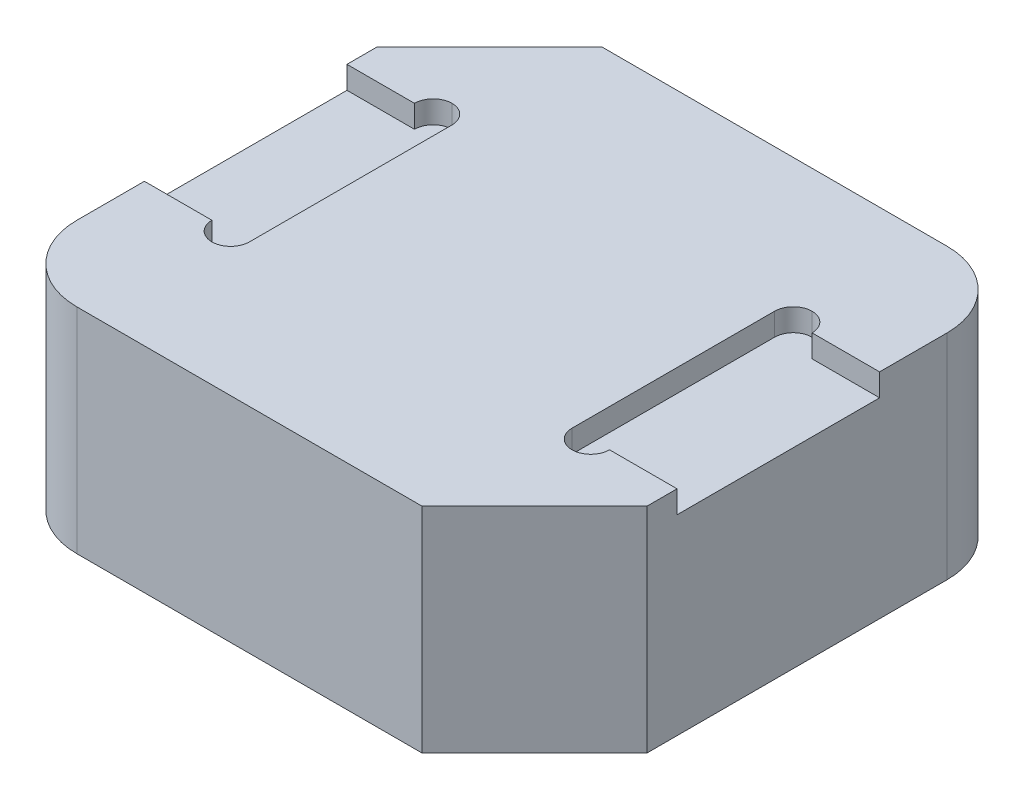
ISO-10303-21;
HEADER;
FILE_DESCRIPTION(('STEP AP214'),'2;1');
FILE_NAME('part.step','',(''),(''),'','','');
FILE_SCHEMA(('AUTOMOTIVE_DESIGN { 1 0 10303 214 1 1 1 1 }'));
ENDSEC;
DATA;
#1=APPLICATION_CONTEXT('core data for automotive mechanical design processes');
#2=APPLICATION_PROTOCOL_DEFINITION('international standard','automotive_design',2000,#1);
#3=PRODUCT_CONTEXT('',#1,'mechanical');
#4=PRODUCT('Part','Part','',(#3));
#5=PRODUCT_RELATED_PRODUCT_CATEGORY('part','',(#4));
#6=PRODUCT_DEFINITION_FORMATION('','',#4);
#7=PRODUCT_DEFINITION_CONTEXT('part definition',#1,'design');
#8=PRODUCT_DEFINITION('design','',#6,#7);
#9=PRODUCT_DEFINITION_SHAPE('','',#8);
#10=(LENGTH_UNIT() NAMED_UNIT(*) SI_UNIT(.MILLI.,.METRE.));
#11=(NAMED_UNIT(*) PLANE_ANGLE_UNIT() SI_UNIT($,.RADIAN.));
#12=(NAMED_UNIT(*) SI_UNIT($,.STERADIAN.) SOLID_ANGLE_UNIT());
#13=UNCERTAINTY_MEASURE_WITH_UNIT(LENGTH_MEASURE(1.E-05),#10,'distance_accuracy_value','');
#14=(GEOMETRIC_REPRESENTATION_CONTEXT(3) GLOBAL_UNCERTAINTY_ASSIGNED_CONTEXT((#13)) GLOBAL_UNIT_ASSIGNED_CONTEXT((#10,
#11,#12)) REPRESENTATION_CONTEXT('',''));
#15=CARTESIAN_POINT('',(0.,0.,0.));
#16=DIRECTION('',(0.,0.,1.));
#17=DIRECTION('',(1.,0.,0.));
#18=AXIS2_PLACEMENT_3D('',#15,#16,#17);
#19=CARTESIAN_POINT('',(0.,2.85,0.));
#20=DIRECTION('',(0.,-1.,0.));
#21=DIRECTION('',(0.,0.,-1.));
#22=AXIS2_PLACEMENT_3D('',#19,#20,#21);
#23=PLANE('',#22);
#24=CARTESIAN_POINT('',(-2.4,2.85,-1.35));
#25=DIRECTION('',(0.,-1.,0.));
#26=DIRECTION('',(0.,0.,-1.));
#27=AXIS2_PLACEMENT_3D('',#24,#25,#26);
#28=CIRCLE('',#27,0.25);
#29=CARTESIAN_POINT('',(-2.65,2.85,-1.35));
#30=VERTEX_POINT('',#29);
#31=CARTESIAN_POINT('',(-2.4,2.85,-1.6));
#32=VERTEX_POINT('',#31);
#33=EDGE_CURVE('E48',#30,#32,#28,.T.);
#34=ORIENTED_EDGE('',*,*,#33,.T.);
#35=CARTESIAN_POINT('',(-2.4,2.85,-1.35));
#36=DIRECTION('',(0.,-1.,0.));
#37=DIRECTION('',(0.,0.,-1.));
#38=AXIS2_PLACEMENT_3D('',#35,#36,#37);
#39=CIRCLE('',#38,0.25);
#40=CARTESIAN_POINT('',(-2.15,2.85,-1.35));
#41=VERTEX_POINT('',#40);
#42=EDGE_CURVE('E11',#32,#41,#39,.T.);
#43=ORIENTED_EDGE('',*,*,#42,.T.);
#44=DIRECTION('',(0.,0.,1.));
#45=VECTOR('',#44,1.);
#46=CARTESIAN_POINT('',(-2.15,2.85,-1.6));
#47=LINE('',#46,#45);
#48=CARTESIAN_POINT('',(-2.15,2.85,1.35));
#49=VERTEX_POINT('',#48);
#50=EDGE_CURVE('E423',#41,#49,#47,.T.);
#51=ORIENTED_EDGE('',*,*,#50,.T.);
#52=CARTESIAN_POINT('',(-2.4,2.85,1.35));
#53=DIRECTION('',(0.,-1.,0.));
#54=DIRECTION('',(0.,0.,-1.));
#55=AXIS2_PLACEMENT_3D('',#52,#53,#54);
#56=CIRCLE('',#55,0.25);
#57=CARTESIAN_POINT('',(-2.4,2.85,1.6));
#58=VERTEX_POINT('',#57);
#59=EDGE_CURVE('E61',#49,#58,#56,.T.);
#60=ORIENTED_EDGE('',*,*,#59,.T.);
#61=CARTESIAN_POINT('',(-2.4,2.85,1.35));
#62=DIRECTION('',(0.,-1.,0.));
#63=DIRECTION('',(0.,0.,-1.));
#64=AXIS2_PLACEMENT_3D('',#61,#62,#63);
#65=CIRCLE('',#64,0.25);
#66=CARTESIAN_POINT('',(-2.65,2.85,1.35));
#67=VERTEX_POINT('',#66);
#68=EDGE_CURVE('E199',#58,#67,#65,.T.);
#69=ORIENTED_EDGE('',*,*,#68,.T.);
#70=DIRECTION('',(-1.,0.,0.));
#71=VECTOR('',#70,1.);
#72=CARTESIAN_POINT('',(-3.55,2.85,1.35));
#73=LINE('',#72,#71);
#74=CARTESIAN_POINT('',(-3.55,2.85,1.35));
#75=VERTEX_POINT('',#74);
#76=EDGE_CURVE('E201',#67,#75,#73,.T.);
#77=ORIENTED_EDGE('',*,*,#76,.T.);
#78=DIRECTION('',(0.,0.,1.));
#79=VECTOR('',#78,1.);
#80=CARTESIAN_POINT('',(-3.55,2.85,3.25));
#81=LINE('',#80,#79);
#82=CARTESIAN_POINT('',(-3.55,2.85,2.25));
#83=VERTEX_POINT('',#82);
#84=EDGE_CURVE('E286',#75,#83,#81,.T.);
#85=ORIENTED_EDGE('',*,*,#84,.T.);
#86=CARTESIAN_POINT('',(-2.55,2.85,2.25));
#87=DIRECTION('',(0.,-1.,0.));
#88=DIRECTION('',(0.,0.,-1.));
#89=AXIS2_PLACEMENT_3D('',#86,#87,#88);
#90=CIRCLE('',#89,1.);
#91=CARTESIAN_POINT('',(-2.55,2.85,3.25));
#92=VERTEX_POINT('',#91);
#93=EDGE_CURVE('E351',#83,#92,#90,.F.);
#94=ORIENTED_EDGE('',*,*,#93,.T.);
#95=DIRECTION('',(1.,0.,0.));
#96=VECTOR('',#95,1.);
#97=CARTESIAN_POINT('',(-3.55,2.85,3.25));
#98=LINE('',#97,#96);
#99=CARTESIAN_POINT('',(2.04999999999999,2.85,3.25));
#100=VERTEX_POINT('',#99);
#101=EDGE_CURVE('E291',#92,#100,#98,.T.);
#102=ORIENTED_EDGE('',*,*,#101,.T.);
#103=DIRECTION('',(-0.707106781186549,0.,0.707106781186546));
#104=VECTOR('',#103,1.);
#105=CARTESIAN_POINT('',(3.55,2.85,1.75));
#106=LINE('',#105,#104);
#107=CARTESIAN_POINT('',(3.55,2.85,1.75));
#108=VERTEX_POINT('',#107);
#109=EDGE_CURVE('E326',#100,#108,#106,.F.);
#110=ORIENTED_EDGE('',*,*,#109,.T.);
#111=DIRECTION('',(0.,0.,-1.));
#112=VECTOR('',#111,1.);
#113=CARTESIAN_POINT('',(3.55,2.85,3.25));
#114=LINE('',#113,#112);
#115=CARTESIAN_POINT('',(3.55,2.85,1.35));
#116=VERTEX_POINT('',#115);
#117=EDGE_CURVE('E278',#108,#116,#114,.T.);
#118=ORIENTED_EDGE('',*,*,#117,.T.);
#119=DIRECTION('',(1.,0.,0.));
#120=VECTOR('',#119,1.);
#121=CARTESIAN_POINT('',(3.55,2.85,1.35));
#122=LINE('',#121,#120);
#123=CARTESIAN_POINT('',(2.65,2.85,1.35));
#124=VERTEX_POINT('',#123);
#125=EDGE_CURVE('E249',#124,#116,#122,.T.);
#126=ORIENTED_EDGE('',*,*,#125,.F.);
#127=CARTESIAN_POINT('',(2.4,2.85,1.35));
#128=DIRECTION('',(0.,-1.,0.));
#129=DIRECTION('',(0.,0.,-1.));
#130=AXIS2_PLACEMENT_3D('',#127,#128,#129);
#131=CIRCLE('',#130,0.25);
#132=CARTESIAN_POINT('',(2.4,2.85,1.6));
#133=VERTEX_POINT('',#132);
#134=EDGE_CURVE('E383',#124,#133,#131,.T.);
#135=ORIENTED_EDGE('',*,*,#134,.T.);
#136=CARTESIAN_POINT('',(2.4,2.85,1.35));
#137=DIRECTION('',(0.,-1.,0.));
#138=DIRECTION('',(0.,0.,-1.));
#139=AXIS2_PLACEMENT_3D('',#136,#137,#138);
#140=CIRCLE('',#139,0.25);
#141=CARTESIAN_POINT('',(2.15,2.85,1.35));
#142=VERTEX_POINT('',#141);
#143=EDGE_CURVE('E386',#133,#142,#140,.T.);
#144=ORIENTED_EDGE('',*,*,#143,.T.);
#145=DIRECTION('',(0.,0.,1.));
#146=VECTOR('',#145,1.);
#147=CARTESIAN_POINT('',(2.15,2.85,-1.6));
#148=LINE('',#147,#146);
#149=CARTESIAN_POINT('',(2.15,2.85,-1.35));
#150=VERTEX_POINT('',#149);
#151=EDGE_CURVE('E239',#150,#142,#148,.T.);
#152=ORIENTED_EDGE('',*,*,#151,.F.);
#153=CARTESIAN_POINT('',(2.4,2.85,-1.35));
#154=DIRECTION('',(0.,-1.,0.));
#155=DIRECTION('',(0.,0.,-1.));
#156=AXIS2_PLACEMENT_3D('',#153,#154,#155);
#157=CIRCLE('',#156,0.25);
#158=CARTESIAN_POINT('',(2.4,2.85,-1.6));
#159=VERTEX_POINT('',#158);
#160=EDGE_CURVE('E392',#150,#159,#157,.T.);
#161=ORIENTED_EDGE('',*,*,#160,.T.);
#162=CARTESIAN_POINT('',(2.4,2.85,-1.35));
#163=DIRECTION('',(0.,-1.,0.));
#164=DIRECTION('',(0.,0.,-1.));
#165=AXIS2_PLACEMENT_3D('',#162,#163,#164);
#166=CIRCLE('',#165,0.25);
#167=CARTESIAN_POINT('',(2.65,2.85,-1.35));
#168=VERTEX_POINT('',#167);
#169=EDGE_CURVE('E389',#159,#168,#166,.T.);
#170=ORIENTED_EDGE('',*,*,#169,.T.);
#171=DIRECTION('',(-1.,0.,0.));
#172=VECTOR('',#171,1.);
#173=CARTESIAN_POINT('',(3.55,2.85,-1.35));
#174=LINE('',#173,#172);
#175=CARTESIAN_POINT('',(3.55,2.85,-1.35));
#176=VERTEX_POINT('',#175);
#177=EDGE_CURVE('E238',#176,#168,#174,.T.);
#178=ORIENTED_EDGE('',*,*,#177,.F.);
#179=CARTESIAN_POINT('',(3.55,2.85,-2.25));
#180=VERTEX_POINT('',#179);
#181=EDGE_CURVE('E283',#176,#180,#114,.T.);
#182=ORIENTED_EDGE('',*,*,#181,.T.);
#183=CARTESIAN_POINT('',(2.55,2.85,-2.25));
#184=DIRECTION('',(0.,-1.,0.));
#185=DIRECTION('',(0.,0.,-1.));
#186=AXIS2_PLACEMENT_3D('',#183,#184,#185);
#187=CIRCLE('',#186,1.);
#188=CARTESIAN_POINT('',(2.55,2.85,-3.25));
#189=VERTEX_POINT('',#188);
#190=EDGE_CURVE('E354',#180,#189,#187,.F.);
#191=ORIENTED_EDGE('',*,*,#190,.T.);
#192=DIRECTION('',(-1.,0.,0.));
#193=VECTOR('',#192,1.);
#194=CARTESIAN_POINT('',(-3.55,2.85,-3.25));
#195=LINE('',#194,#193);
#196=CARTESIAN_POINT('',(-2.05,2.85,-3.25));
#197=VERTEX_POINT('',#196);
#198=EDGE_CURVE('E282',#189,#197,#195,.T.);
#199=ORIENTED_EDGE('',*,*,#198,.T.);
#200=DIRECTION('',(0.707106781186549,0.,-0.707106781186546));
#201=VECTOR('',#200,1.);
#202=CARTESIAN_POINT('',(-3.55,2.85,-1.75));
#203=LINE('',#202,#201);
#204=CARTESIAN_POINT('',(-3.55,2.85,-1.75));
#205=VERTEX_POINT('',#204);
#206=EDGE_CURVE('E323',#197,#205,#203,.F.);
#207=ORIENTED_EDGE('',*,*,#206,.T.);
#208=CARTESIAN_POINT('',(-3.55,2.85,-1.35));
#209=VERTEX_POINT('',#208);
#210=EDGE_CURVE('E287',#205,#209,#81,.T.);
#211=ORIENTED_EDGE('',*,*,#210,.T.);
#212=DIRECTION('',(1.,0.,0.));
#213=VECTOR('',#212,1.);
#214=CARTESIAN_POINT('',(-3.55,2.85,-1.35));
#215=LINE('',#214,#213);
#216=EDGE_CURVE('E217',#209,#30,#215,.T.);
#217=ORIENTED_EDGE('',*,*,#216,.T.);
#218=EDGE_LOOP('',(#34,#43,#51,#60,#69,#77,#85,#94,#102,#110,#118,#126,#135,#144,#152,#161,#170,
#178,#182,#191,#199,#207,#211,#217));
#219=FACE_BOUND('',#218,.T.);
#220=ADVANCED_FACE('F38',(#219),#23,.F.);
#221=CARTESIAN_POINT('',(-3.55,2.85,3.25));
#222=DIRECTION('',(1.,0.,0.));
#223=DIRECTION('',(0.,0.,-1.));
#224=AXIS2_PLACEMENT_3D('',#221,#222,#223);
#225=PLANE('',#224);
#226=DIRECTION('',(0.,1.,0.));
#227=VECTOR('',#226,1.);
#228=CARTESIAN_POINT('',(-3.55,2.55,-1.35));
#229=LINE('',#228,#227);
#230=CARTESIAN_POINT('',(-3.55,2.55,-1.35));
#231=VERTEX_POINT('',#230);
#232=EDGE_CURVE('E228',#231,#209,#229,.T.);
#233=ORIENTED_EDGE('',*,*,#232,.T.);
#234=ORIENTED_EDGE('',*,*,#210,.F.);
#235=DIRECTION('',(0.,-1.,0.));
#236=VECTOR('',#235,1.);
#237=CARTESIAN_POINT('',(-3.55,2.85,-1.75));
#238=LINE('',#237,#236);
#239=CARTESIAN_POINT('',(-3.55,0.,-1.75));
#240=VERTEX_POINT('',#239);
#241=EDGE_CURVE('E329',#205,#240,#238,.T.);
#242=ORIENTED_EDGE('',*,*,#241,.T.);
#243=DIRECTION('',(0.,0.,1.));
#244=VECTOR('',#243,1.);
#245=CARTESIAN_POINT('',(-3.55,0.,3.25));
#246=LINE('',#245,#244);
#247=CARTESIAN_POINT('',(-3.55,0.,2.25));
#248=VERTEX_POINT('',#247);
#249=EDGE_CURVE('E301',#240,#248,#246,.T.);
#250=ORIENTED_EDGE('',*,*,#249,.T.);
#251=DIRECTION('',(0.,-1.,0.));
#252=VECTOR('',#251,1.);
#253=CARTESIAN_POINT('',(-3.55,2.85,2.25));
#254=LINE('',#253,#252);
#255=EDGE_CURVE('E361',#248,#83,#254,.F.);
#256=ORIENTED_EDGE('',*,*,#255,.T.);
#257=ORIENTED_EDGE('',*,*,#84,.F.);
#258=DIRECTION('',(0.,1.,0.));
#259=VECTOR('',#258,1.);
#260=CARTESIAN_POINT('',(-3.55,2.55,1.35));
#261=LINE('',#260,#259);
#262=CARTESIAN_POINT('',(-3.55,2.55,1.35));
#263=VERTEX_POINT('',#262);
#264=EDGE_CURVE('E215',#263,#75,#261,.T.);
#265=ORIENTED_EDGE('',*,*,#264,.F.);
#266=DIRECTION('',(0.,0.,-1.));
#267=VECTOR('',#266,1.);
#268=CARTESIAN_POINT('',(-3.55,2.55,-1.35));
#269=LINE('',#268,#267);
#270=EDGE_CURVE('E450',#263,#231,#269,.T.);
#271=ORIENTED_EDGE('',*,*,#270,.T.);
#272=EDGE_LOOP('',(#233,#234,#242,#250,#256,#257,#265,#271));
#273=FACE_BOUND('',#272,.T.);
#274=ADVANCED_FACE('F465',(#273),#225,.F.);
#275=CARTESIAN_POINT('',(3.55,2.85,3.25));
#276=DIRECTION('',(-1.,0.,0.));
#277=DIRECTION('',(0.,0.,1.));
#278=AXIS2_PLACEMENT_3D('',#275,#276,#277);
#279=PLANE('',#278);
#280=DIRECTION('',(0.,0.,-1.));
#281=VECTOR('',#280,1.);
#282=CARTESIAN_POINT('',(3.55,2.55,-1.35));
#283=LINE('',#282,#281);
#284=CARTESIAN_POINT('',(3.55,2.55,1.35));
#285=VERTEX_POINT('',#284);
#286=CARTESIAN_POINT('',(3.55,2.55,-1.35));
#287=VERTEX_POINT('',#286);
#288=EDGE_CURVE('E244',#285,#287,#283,.T.);
#289=ORIENTED_EDGE('',*,*,#288,.F.);
#290=DIRECTION('',(0.,1.,0.));
#291=VECTOR('',#290,1.);
#292=CARTESIAN_POINT('',(3.55,2.55,1.35));
#293=LINE('',#292,#291);
#294=EDGE_CURVE('E263',#285,#116,#293,.T.);
#295=ORIENTED_EDGE('',*,*,#294,.T.);
#296=ORIENTED_EDGE('',*,*,#117,.F.);
#297=DIRECTION('',(0.,-1.,0.));
#298=VECTOR('',#297,1.);
#299=CARTESIAN_POINT('',(3.55,2.85,1.75));
#300=LINE('',#299,#298);
#301=CARTESIAN_POINT('',(3.55,0.,1.75));
#302=VERTEX_POINT('',#301);
#303=EDGE_CURVE('E294',#108,#302,#300,.T.);
#304=ORIENTED_EDGE('',*,*,#303,.T.);
#305=DIRECTION('',(0.,0.,-1.));
#306=VECTOR('',#305,1.);
#307=CARTESIAN_POINT('',(3.55,0.,3.25));
#308=LINE('',#307,#306);
#309=CARTESIAN_POINT('',(3.55,0.,-2.25));
#310=VERTEX_POINT('',#309);
#311=EDGE_CURVE('E267',#302,#310,#308,.T.);
#312=ORIENTED_EDGE('',*,*,#311,.T.);
#313=DIRECTION('',(0.,-1.,0.));
#314=VECTOR('',#313,1.);
#315=CARTESIAN_POINT('',(3.55,2.85,-2.25));
#316=LINE('',#315,#314);
#317=EDGE_CURVE('E347',#310,#180,#316,.F.);
#318=ORIENTED_EDGE('',*,*,#317,.T.);
#319=ORIENTED_EDGE('',*,*,#181,.F.);
#320=DIRECTION('',(0.,1.,0.));
#321=VECTOR('',#320,1.);
#322=CARTESIAN_POINT('',(3.55,2.55,-1.35));
#323=LINE('',#322,#321);
#324=EDGE_CURVE('E257',#287,#176,#323,.T.);
#325=ORIENTED_EDGE('',*,*,#324,.F.);
#326=EDGE_LOOP('',(#289,#295,#296,#304,#312,#318,#319,#325));
#327=FACE_BOUND('',#326,.T.);
#328=ADVANCED_FACE('F498',(#327),#279,.F.);
#329=CARTESIAN_POINT('',(-3.55,2.85,-3.25));
#330=DIRECTION('',(0.,0.,1.));
#331=DIRECTION('',(1.,0.,0.));
#332=AXIS2_PLACEMENT_3D('',#329,#330,#331);
#333=PLANE('',#332);
#334=ORIENTED_EDGE('',*,*,#198,.F.);
#335=DIRECTION('',(0.,-1.,0.));
#336=VECTOR('',#335,1.);
#337=CARTESIAN_POINT('',(2.55,2.85,-3.25));
#338=LINE('',#337,#336);
#339=CARTESIAN_POINT('',(2.55,0.,-3.25));
#340=VERTEX_POINT('',#339);
#341=EDGE_CURVE('E337',#189,#340,#338,.T.);
#342=ORIENTED_EDGE('',*,*,#341,.T.);
#343=DIRECTION('',(-1.,0.,0.));
#344=VECTOR('',#343,1.);
#345=CARTESIAN_POINT('',(-3.55,0.,-3.25));
#346=LINE('',#345,#344);
#347=CARTESIAN_POINT('',(-2.05,0.,-3.25));
#348=VERTEX_POINT('',#347);
#349=EDGE_CURVE('E298',#340,#348,#346,.T.);
#350=ORIENTED_EDGE('',*,*,#349,.T.);
#351=DIRECTION('',(0.,1.,0.));
#352=VECTOR('',#351,1.);
#353=CARTESIAN_POINT('',(-2.05,2.85,-3.25));
#354=LINE('',#353,#352);
#355=EDGE_CURVE('E333',#348,#197,#354,.T.);
#356=ORIENTED_EDGE('',*,*,#355,.T.);
#357=EDGE_LOOP('',(#334,#342,#350,#356));
#358=FACE_BOUND('',#357,.T.);
#359=ADVANCED_FACE('F504',(#358),#333,.F.);
#360=CARTESIAN_POINT('',(-3.55,2.85,3.25));
#361=DIRECTION('',(0.,0.,-1.));
#362=DIRECTION('',(-1.,0.,0.));
#363=AXIS2_PLACEMENT_3D('',#360,#361,#362);
#364=PLANE('',#363);
#365=ORIENTED_EDGE('',*,*,#101,.F.);
#366=DIRECTION('',(0.,-1.,0.));
#367=VECTOR('',#366,1.);
#368=CARTESIAN_POINT('',(-2.55,2.85,3.25));
#369=LINE('',#368,#367);
#370=CARTESIAN_POINT('',(-2.55,0.,3.25));
#371=VERTEX_POINT('',#370);
#372=EDGE_CURVE('E357',#92,#371,#369,.T.);
#373=ORIENTED_EDGE('',*,*,#372,.T.);
#374=DIRECTION('',(1.,0.,0.));
#375=VECTOR('',#374,1.);
#376=CARTESIAN_POINT('',(-3.55,0.,3.25));
#377=LINE('',#376,#375);
#378=CARTESIAN_POINT('',(2.04999999999999,0.,3.25));
#379=VERTEX_POINT('',#378);
#380=EDGE_CURVE('E305',#371,#379,#377,.T.);
#381=ORIENTED_EDGE('',*,*,#380,.T.);
#382=DIRECTION('',(0.,1.,0.));
#383=VECTOR('',#382,1.);
#384=CARTESIAN_POINT('',(2.05,2.85,3.25));
#385=LINE('',#384,#383);
#386=EDGE_CURVE('E319',#379,#100,#385,.T.);
#387=ORIENTED_EDGE('',*,*,#386,.T.);
#388=EDGE_LOOP('',(#365,#373,#381,#387));
#389=FACE_BOUND('',#388,.T.);
#390=ADVANCED_FACE('F485',(#389),#364,.F.);
#391=CARTESIAN_POINT('',(0.,0.,0.));
#392=DIRECTION('',(0.,-1.,0.));
#393=DIRECTION('',(0.,0.,-1.));
#394=AXIS2_PLACEMENT_3D('',#391,#392,#393);
#395=PLANE('',#394);
#396=ORIENTED_EDGE('',*,*,#349,.F.);
#397=CARTESIAN_POINT('',(2.55,0.,-2.25));
#398=DIRECTION('',(0.,-1.,0.));
#399=DIRECTION('',(0.,0.,-1.));
#400=AXIS2_PLACEMENT_3D('',#397,#398,#399);
#401=CIRCLE('',#400,1.);
#402=EDGE_CURVE('E344',#340,#310,#401,.T.);
#403=ORIENTED_EDGE('',*,*,#402,.T.);
#404=ORIENTED_EDGE('',*,*,#311,.F.);
#405=DIRECTION('',(0.707106781186549,0.,-0.707106781186546));
#406=VECTOR('',#405,1.);
#407=CARTESIAN_POINT('',(2.64999999999999,0.,2.65));
#408=LINE('',#407,#406);
#409=EDGE_CURVE('E315',#302,#379,#408,.F.);
#410=ORIENTED_EDGE('',*,*,#409,.T.);
#411=ORIENTED_EDGE('',*,*,#380,.F.);
#412=CARTESIAN_POINT('',(-2.55,0.,2.25));
#413=DIRECTION('',(0.,-1.,0.));
#414=DIRECTION('',(0.,0.,-1.));
#415=AXIS2_PLACEMENT_3D('',#412,#413,#414);
#416=CIRCLE('',#415,1.);
#417=EDGE_CURVE('E341',#371,#248,#416,.T.);
#418=ORIENTED_EDGE('',*,*,#417,.T.);
#419=ORIENTED_EDGE('',*,*,#249,.F.);
#420=DIRECTION('',(-0.707106781186549,0.,0.707106781186546));
#421=VECTOR('',#420,1.);
#422=CARTESIAN_POINT('',(-2.64999999999999,0.,-2.65));
#423=LINE('',#422,#421);
#424=EDGE_CURVE('E311',#240,#348,#423,.F.);
#425=ORIENTED_EDGE('',*,*,#424,.T.);
#426=EDGE_LOOP('',(#396,#403,#404,#410,#411,#418,#419,#425));
#427=FACE_BOUND('',#426,.T.);
#428=ADVANCED_FACE('F477',(#427),#395,.T.);
#429=CARTESIAN_POINT('',(3.55,2.85,1.75));
#430=DIRECTION('',(-0.707106781186546,0.,-0.707106781186549));
#431=DIRECTION('',(0.,-1.,0.));
#432=AXIS2_PLACEMENT_3D('',#429,#430,#431);
#433=PLANE('',#432);
#434=ORIENTED_EDGE('',*,*,#109,.F.);
#435=ORIENTED_EDGE('',*,*,#386,.F.);
#436=ORIENTED_EDGE('',*,*,#409,.F.);
#437=ORIENTED_EDGE('',*,*,#303,.F.);
#438=EDGE_LOOP('',(#434,#435,#436,#437));
#439=FACE_BOUND('',#438,.T.);
#440=ADVANCED_FACE('F507',(#439),#433,.F.);
#441=CARTESIAN_POINT('',(-3.55,2.85,-1.75));
#442=DIRECTION('',(0.707106781186546,0.,0.707106781186549));
#443=DIRECTION('',(0.,-1.,0.));
#444=AXIS2_PLACEMENT_3D('',#441,#442,#443);
#445=PLANE('',#444);
#446=ORIENTED_EDGE('',*,*,#206,.F.);
#447=ORIENTED_EDGE('',*,*,#355,.F.);
#448=ORIENTED_EDGE('',*,*,#424,.F.);
#449=ORIENTED_EDGE('',*,*,#241,.F.);
#450=EDGE_LOOP('',(#446,#447,#448,#449));
#451=FACE_BOUND('',#450,.T.);
#452=ADVANCED_FACE('F472',(#451),#445,.F.);
#453=CARTESIAN_POINT('',(2.55,2.85,-2.25));
#454=DIRECTION('',(0.,-1.,0.));
#455=DIRECTION('',(0.,0.,-1.));
#456=AXIS2_PLACEMENT_3D('',#453,#454,#455);
#457=CYLINDRICAL_SURFACE('',#456,1.);
#458=ORIENTED_EDGE('',*,*,#190,.F.);
#459=ORIENTED_EDGE('',*,*,#317,.F.);
#460=ORIENTED_EDGE('',*,*,#402,.F.);
#461=ORIENTED_EDGE('',*,*,#341,.F.);
#462=EDGE_LOOP('',(#458,#459,#460,#461));
#463=FACE_BOUND('',#462,.T.);
#464=ADVANCED_FACE('F502',(#463),#457,.T.);
#465=CARTESIAN_POINT('',(-2.55,2.85,2.25));
#466=DIRECTION('',(0.,-1.,0.));
#467=DIRECTION('',(0.,0.,-1.));
#468=AXIS2_PLACEMENT_3D('',#465,#466,#467);
#469=CYLINDRICAL_SURFACE('',#468,1.);
#470=ORIENTED_EDGE('',*,*,#93,.F.);
#471=ORIENTED_EDGE('',*,*,#255,.F.);
#472=ORIENTED_EDGE('',*,*,#417,.F.);
#473=ORIENTED_EDGE('',*,*,#372,.F.);
#474=EDGE_LOOP('',(#470,#471,#472,#473));
#475=FACE_BOUND('',#474,.T.);
#476=ADVANCED_FACE('F482',(#475),#469,.T.);
#477=CARTESIAN_POINT('',(3.55,2.55,1.35));
#478=DIRECTION('',(0.,0.,1.));
#479=DIRECTION('',(1.,0.,0.));
#480=AXIS2_PLACEMENT_3D('',#477,#478,#479);
#481=PLANE('',#480);
#482=ORIENTED_EDGE('',*,*,#125,.T.);
#483=ORIENTED_EDGE('',*,*,#294,.F.);
#484=DIRECTION('',(1.,0.,0.));
#485=VECTOR('',#484,1.);
#486=CARTESIAN_POINT('',(3.55,2.55,1.35));
#487=LINE('',#486,#485);
#488=CARTESIAN_POINT('',(2.65,2.55,1.35));
#489=VERTEX_POINT('',#488);
#490=EDGE_CURVE('E253',#489,#285,#487,.T.);
#491=ORIENTED_EDGE('',*,*,#490,.F.);
#492=DIRECTION('',(0.,1.,0.));
#493=VECTOR('',#492,1.);
#494=CARTESIAN_POINT('',(2.65,2.55,1.35));
#495=LINE('',#494,#493);
#496=EDGE_CURVE('E268',#489,#124,#495,.T.);
#497=ORIENTED_EDGE('',*,*,#496,.T.);
#498=EDGE_LOOP('',(#482,#483,#491,#497));
#499=FACE_BOUND('',#498,.T.);
#500=ADVANCED_FACE('F511',(#499),#481,.F.);
#501=CARTESIAN_POINT('',(3.55,2.55,-1.35));
#502=DIRECTION('',(0.,0.,-1.));
#503=DIRECTION('',(-1.,0.,0.));
#504=AXIS2_PLACEMENT_3D('',#501,#502,#503);
#505=PLANE('',#504);
#506=ORIENTED_EDGE('',*,*,#177,.T.);
#507=DIRECTION('',(0.,1.,0.));
#508=VECTOR('',#507,1.);
#509=CARTESIAN_POINT('',(2.65,2.55,-1.35));
#510=LINE('',#509,#508);
#511=CARTESIAN_POINT('',(2.65,2.55,-1.35));
#512=VERTEX_POINT('',#511);
#513=EDGE_CURVE('E272',#512,#168,#510,.T.);
#514=ORIENTED_EDGE('',*,*,#513,.F.);
#515=DIRECTION('',(-1.,0.,0.));
#516=VECTOR('',#515,1.);
#517=CARTESIAN_POINT('',(3.55,2.55,-1.35));
#518=LINE('',#517,#516);
#519=EDGE_CURVE('E248',#287,#512,#518,.T.);
#520=ORIENTED_EDGE('',*,*,#519,.F.);
#521=ORIENTED_EDGE('',*,*,#324,.T.);
#522=EDGE_LOOP('',(#506,#514,#520,#521));
#523=FACE_BOUND('',#522,.T.);
#524=ADVANCED_FACE('F536',(#523),#505,.F.);
#525=CARTESIAN_POINT('',(0.,2.55,0.));
#526=DIRECTION('',(0.,-1.,0.));
#527=DIRECTION('',(0.,0.,-1.));
#528=AXIS2_PLACEMENT_3D('',#525,#526,#527);
#529=PLANE('',#528);
#530=CARTESIAN_POINT('',(2.4,2.55,1.35));
#531=DIRECTION('',(0.,-1.,0.));
#532=DIRECTION('',(0.,0.,-1.));
#533=AXIS2_PLACEMENT_3D('',#530,#531,#532);
#534=CIRCLE('',#533,0.25);
#535=CARTESIAN_POINT('',(2.15,2.55,1.35));
#536=VERTEX_POINT('',#535);
#537=CARTESIAN_POINT('',(2.4,2.55,1.6));
#538=VERTEX_POINT('',#537);
#539=EDGE_CURVE('E371',#536,#538,#534,.F.);
#540=ORIENTED_EDGE('',*,*,#539,.T.);
#541=CARTESIAN_POINT('',(2.4,2.55,1.35));
#542=DIRECTION('',(0.,-1.,0.));
#543=DIRECTION('',(0.,0.,-1.));
#544=AXIS2_PLACEMENT_3D('',#541,#542,#543);
#545=CIRCLE('',#544,0.25);
#546=EDGE_CURVE('E374',#538,#489,#545,.F.);
#547=ORIENTED_EDGE('',*,*,#546,.T.);
#548=ORIENTED_EDGE('',*,*,#490,.T.);
#549=ORIENTED_EDGE('',*,*,#288,.T.);
#550=ORIENTED_EDGE('',*,*,#519,.T.);
#551=CARTESIAN_POINT('',(2.4,2.55,-1.35));
#552=DIRECTION('',(0.,-1.,0.));
#553=DIRECTION('',(0.,0.,-1.));
#554=AXIS2_PLACEMENT_3D('',#551,#552,#553);
#555=CIRCLE('',#554,0.25);
#556=CARTESIAN_POINT('',(2.4,2.55,-1.6));
#557=VERTEX_POINT('',#556);
#558=EDGE_CURVE('E368',#512,#557,#555,.F.);
#559=ORIENTED_EDGE('',*,*,#558,.T.);
#560=CARTESIAN_POINT('',(2.4,2.55,-1.35));
#561=DIRECTION('',(0.,-1.,0.));
#562=DIRECTION('',(0.,0.,-1.));
#563=AXIS2_PLACEMENT_3D('',#560,#561,#562);
#564=CIRCLE('',#563,0.25);
#565=CARTESIAN_POINT('',(2.15,2.55,-1.35));
#566=VERTEX_POINT('',#565);
#567=EDGE_CURVE('E365',#557,#566,#564,.F.);
#568=ORIENTED_EDGE('',*,*,#567,.T.);
#569=DIRECTION('',(0.,0.,1.));
#570=VECTOR('',#569,1.);
#571=CARTESIAN_POINT('',(2.15,2.55,-1.6));
#572=LINE('',#571,#570);
#573=EDGE_CURVE('E234',#566,#536,#572,.T.);
#574=ORIENTED_EDGE('',*,*,#573,.T.);
#575=EDGE_LOOP('',(#540,#547,#548,#549,#550,#559,#568,#574));
#576=FACE_BOUND('',#575,.T.);
#577=ADVANCED_FACE('F539',(#576),#529,.F.);
#578=CARTESIAN_POINT('',(2.15,2.55,-1.6));
#579=DIRECTION('',(-1.,0.,0.));
#580=DIRECTION('',(0.,0.,1.));
#581=AXIS2_PLACEMENT_3D('',#578,#579,#580);
#582=PLANE('',#581);
#583=ORIENTED_EDGE('',*,*,#151,.T.);
#584=DIRECTION('',(0.,1.,0.));
#585=VECTOR('',#584,1.);
#586=CARTESIAN_POINT('',(2.15,2.55,1.35));
#587=LINE('',#586,#585);
#588=EDGE_CURVE('E380',#142,#536,#587,.F.);
#589=ORIENTED_EDGE('',*,*,#588,.T.);
#590=ORIENTED_EDGE('',*,*,#573,.F.);
#591=DIRECTION('',(0.,1.,0.));
#592=VECTOR('',#591,1.);
#593=CARTESIAN_POINT('',(2.15,2.85,-1.35));
#594=LINE('',#593,#592);
#595=EDGE_CURVE('E377',#566,#150,#594,.T.);
#596=ORIENTED_EDGE('',*,*,#595,.T.);
#597=EDGE_LOOP('',(#583,#589,#590,#596));
#598=FACE_BOUND('',#597,.T.);
#599=ADVANCED_FACE('F525',(#598),#582,.F.);
#600=CARTESIAN_POINT('',(2.4,2.55,1.35));
#601=DIRECTION('',(0.,-1.,0.));
#602=DIRECTION('',(0.,0.,-1.));
#603=AXIS2_PLACEMENT_3D('',#600,#601,#602);
#604=CYLINDRICAL_SURFACE('',#603,0.25);
#605=DIRECTION('',(0.,1.,0.));
#606=VECTOR('',#605,1.);
#607=CARTESIAN_POINT('',(2.4,2.85,1.6));
#608=LINE('',#607,#606);
#609=EDGE_CURVE('E243',#538,#133,#608,.T.);
#610=ORIENTED_EDGE('',*,*,#609,.F.);
#611=ORIENTED_EDGE('',*,*,#539,.F.);
#612=ORIENTED_EDGE('',*,*,#588,.F.);
#613=ORIENTED_EDGE('',*,*,#143,.F.);
#614=EDGE_LOOP('',(#610,#611,#612,#613));
#615=FACE_BOUND('',#614,.T.);
#616=ADVANCED_FACE('F520',(#615),#604,.F.);
#617=CARTESIAN_POINT('',(2.4,2.55,1.35));
#618=DIRECTION('',(0.,-1.,0.));
#619=DIRECTION('',(0.,0.,-1.));
#620=AXIS2_PLACEMENT_3D('',#617,#618,#619);
#621=CYLINDRICAL_SURFACE('',#620,0.25);
#622=ORIENTED_EDGE('',*,*,#546,.F.);
#623=ORIENTED_EDGE('',*,*,#609,.T.);
#624=ORIENTED_EDGE('',*,*,#134,.F.);
#625=ORIENTED_EDGE('',*,*,#496,.F.);
#626=EDGE_LOOP('',(#622,#623,#624,#625));
#627=FACE_BOUND('',#626,.T.);
#628=ADVANCED_FACE('F516',(#627),#621,.F.);
#629=CARTESIAN_POINT('',(2.4,2.55,-1.35));
#630=DIRECTION('',(0.,-1.,0.));
#631=DIRECTION('',(0.,0.,-1.));
#632=AXIS2_PLACEMENT_3D('',#629,#630,#631);
#633=CYLINDRICAL_SURFACE('',#632,0.25);
#634=ORIENTED_EDGE('',*,*,#595,.F.);
#635=ORIENTED_EDGE('',*,*,#567,.F.);
#636=DIRECTION('',(0.,1.,0.));
#637=VECTOR('',#636,1.);
#638=CARTESIAN_POINT('',(2.4,2.55,-1.6));
#639=LINE('',#638,#637);
#640=EDGE_CURVE('E399',#159,#557,#639,.F.);
#641=ORIENTED_EDGE('',*,*,#640,.F.);
#642=ORIENTED_EDGE('',*,*,#160,.F.);
#643=EDGE_LOOP('',(#634,#635,#641,#642));
#644=FACE_BOUND('',#643,.T.);
#645=ADVANCED_FACE('F530',(#644),#633,.F.);
#646=CARTESIAN_POINT('',(2.4,2.55,-1.35));
#647=DIRECTION('',(0.,-1.,0.));
#648=DIRECTION('',(0.,0.,-1.));
#649=AXIS2_PLACEMENT_3D('',#646,#647,#648);
#650=CYLINDRICAL_SURFACE('',#649,0.25);
#651=ORIENTED_EDGE('',*,*,#558,.F.);
#652=ORIENTED_EDGE('',*,*,#513,.T.);
#653=ORIENTED_EDGE('',*,*,#169,.F.);
#654=ORIENTED_EDGE('',*,*,#640,.T.);
#655=EDGE_LOOP('',(#651,#652,#653,#654));
#656=FACE_BOUND('',#655,.T.);
#657=ADVANCED_FACE('F537',(#656),#650,.F.);
#658=CARTESIAN_POINT('',(-3.55,2.55,-1.35));
#659=DIRECTION('',(0.,0.,1.));
#660=DIRECTION('',(1.,0.,0.));
#661=AXIS2_PLACEMENT_3D('',#658,#659,#660);
#662=PLANE('',#661);
#663=ORIENTED_EDGE('',*,*,#216,.F.);
#664=ORIENTED_EDGE('',*,*,#232,.F.);
#665=DIRECTION('',(1.,0.,0.));
#666=VECTOR('',#665,1.);
#667=CARTESIAN_POINT('',(-3.55,2.55,-1.35));
#668=LINE('',#667,#666);
#669=CARTESIAN_POINT('',(-2.65,2.55,-1.35));
#670=VERTEX_POINT('',#669);
#671=EDGE_CURVE('E230',#231,#670,#668,.T.);
#672=ORIENTED_EDGE('',*,*,#671,.T.);
#673=DIRECTION('',(0.,1.,0.));
#674=VECTOR('',#673,1.);
#675=CARTESIAN_POINT('',(-2.65,2.55,-1.35));
#676=LINE('',#675,#674);
#677=EDGE_CURVE('E223',#670,#30,#676,.T.);
#678=ORIENTED_EDGE('',*,*,#677,.T.);
#679=EDGE_LOOP('',(#663,#664,#672,#678));
#680=FACE_BOUND('',#679,.T.);
#681=ADVANCED_FACE('F578',(#680),#662,.T.);
#682=CARTESIAN_POINT('',(-3.55,2.55,1.35));
#683=DIRECTION('',(0.,0.,-1.));
#684=DIRECTION('',(-1.,0.,0.));
#685=AXIS2_PLACEMENT_3D('',#682,#683,#684);
#686=PLANE('',#685);
#687=ORIENTED_EDGE('',*,*,#76,.F.);
#688=DIRECTION('',(0.,1.,0.));
#689=VECTOR('',#688,1.);
#690=CARTESIAN_POINT('',(-2.65,2.55,1.35));
#691=LINE('',#690,#689);
#692=CARTESIAN_POINT('',(-2.65,2.55,1.35));
#693=VERTEX_POINT('',#692);
#694=EDGE_CURVE('E212',#693,#67,#691,.T.);
#695=ORIENTED_EDGE('',*,*,#694,.F.);
#696=DIRECTION('',(-1.,0.,0.));
#697=VECTOR('',#696,1.);
#698=CARTESIAN_POINT('',(-3.55,2.55,1.35));
#699=LINE('',#698,#697);
#700=EDGE_CURVE('E448',#693,#263,#699,.T.);
#701=ORIENTED_EDGE('',*,*,#700,.T.);
#702=ORIENTED_EDGE('',*,*,#264,.T.);
#703=EDGE_LOOP('',(#687,#695,#701,#702));
#704=FACE_BOUND('',#703,.T.);
#705=ADVANCED_FACE('F211',(#704),#686,.T.);
#706=CARTESIAN_POINT('',(0.,2.55,0.));
#707=DIRECTION('',(0.,-1.,0.));
#708=DIRECTION('',(0.,0.,-1.));
#709=AXIS2_PLACEMENT_3D('',#706,#707,#708);
#710=PLANE('',#709);
#711=ORIENTED_EDGE('',*,*,#700,.F.);
#712=CARTESIAN_POINT('',(-2.4,2.55,1.35));
#713=DIRECTION('',(0.,-1.,0.));
#714=DIRECTION('',(0.,0.,-1.));
#715=AXIS2_PLACEMENT_3D('',#712,#713,#714);
#716=CIRCLE('',#715,0.25);
#717=CARTESIAN_POINT('',(-2.4,2.55,1.6));
#718=VERTEX_POINT('',#717);
#719=EDGE_CURVE('E221',#693,#718,#716,.F.);
#720=ORIENTED_EDGE('',*,*,#719,.T.);
#721=CARTESIAN_POINT('',(-2.4,2.55,1.35));
#722=DIRECTION('',(0.,-1.,0.));
#723=DIRECTION('',(0.,0.,-1.));
#724=AXIS2_PLACEMENT_3D('',#721,#722,#723);
#725=CIRCLE('',#724,0.25);
#726=CARTESIAN_POINT('',(-2.15,2.55,1.35));
#727=VERTEX_POINT('',#726);
#728=EDGE_CURVE('E408',#718,#727,#725,.F.);
#729=ORIENTED_EDGE('',*,*,#728,.T.);
#730=DIRECTION('',(0.,0.,1.));
#731=VECTOR('',#730,1.);
#732=CARTESIAN_POINT('',(-2.15,2.55,-1.6));
#733=LINE('',#732,#731);
#734=CARTESIAN_POINT('',(-2.15,2.55,-1.35));
#735=VERTEX_POINT('',#734);
#736=EDGE_CURVE('E218',#735,#727,#733,.T.);
#737=ORIENTED_EDGE('',*,*,#736,.F.);
#738=CARTESIAN_POINT('',(-2.4,2.55,-1.35));
#739=DIRECTION('',(0.,-1.,0.));
#740=DIRECTION('',(0.,0.,-1.));
#741=AXIS2_PLACEMENT_3D('',#738,#739,#740);
#742=CIRCLE('',#741,0.25);
#743=CARTESIAN_POINT('',(-2.4,2.55,-1.6));
#744=VERTEX_POINT('',#743);
#745=EDGE_CURVE('E395',#735,#744,#742,.F.);
#746=ORIENTED_EDGE('',*,*,#745,.T.);
#747=CARTESIAN_POINT('',(-2.4,2.55,-1.35));
#748=DIRECTION('',(0.,-1.,0.));
#749=DIRECTION('',(0.,0.,-1.));
#750=AXIS2_PLACEMENT_3D('',#747,#748,#749);
#751=CIRCLE('',#750,0.25);
#752=EDGE_CURVE('E405',#744,#670,#751,.F.);
#753=ORIENTED_EDGE('',*,*,#752,.T.);
#754=ORIENTED_EDGE('',*,*,#671,.F.);
#755=ORIENTED_EDGE('',*,*,#270,.F.);
#756=EDGE_LOOP('',(#711,#720,#729,#737,#746,#753,#754,#755));
#757=FACE_BOUND('',#756,.T.);
#758=ADVANCED_FACE('F446',(#757),#710,.F.);
#759=CARTESIAN_POINT('',(-2.15,2.55,-1.6));
#760=DIRECTION('',(-1.,0.,0.));
#761=DIRECTION('',(0.,0.,1.));
#762=AXIS2_PLACEMENT_3D('',#759,#760,#761);
#763=PLANE('',#762);
#764=ORIENTED_EDGE('',*,*,#736,.T.);
#765=DIRECTION('',(0.,1.,0.));
#766=VECTOR('',#765,1.);
#767=CARTESIAN_POINT('',(-2.15,2.85,1.35));
#768=LINE('',#767,#766);
#769=EDGE_CURVE('E207',#727,#49,#768,.T.);
#770=ORIENTED_EDGE('',*,*,#769,.T.);
#771=ORIENTED_EDGE('',*,*,#50,.F.);
#772=DIRECTION('',(0.,1.,0.));
#773=VECTOR('',#772,1.);
#774=CARTESIAN_POINT('',(-2.15,2.55,-1.35));
#775=LINE('',#774,#773);
#776=EDGE_CURVE('E413',#41,#735,#775,.F.);
#777=ORIENTED_EDGE('',*,*,#776,.T.);
#778=EDGE_LOOP('',(#764,#770,#771,#777));
#779=FACE_BOUND('',#778,.T.);
#780=ADVANCED_FACE('F439',(#779),#763,.T.);
#781=CARTESIAN_POINT('',(-2.4,2.55,1.35));
#782=DIRECTION('',(0.,-1.,0.));
#783=DIRECTION('',(0.,0.,-1.));
#784=AXIS2_PLACEMENT_3D('',#781,#782,#783);
#785=CYLINDRICAL_SURFACE('',#784,0.25);
#786=ORIENTED_EDGE('',*,*,#769,.F.);
#787=ORIENTED_EDGE('',*,*,#728,.F.);
#788=DIRECTION('',(0.,1.,0.));
#789=VECTOR('',#788,1.);
#790=CARTESIAN_POINT('',(-2.4,2.55,1.6));
#791=LINE('',#790,#789);
#792=EDGE_CURVE('E421',#58,#718,#791,.F.);
#793=ORIENTED_EDGE('',*,*,#792,.F.);
#794=ORIENTED_EDGE('',*,*,#59,.F.);
#795=EDGE_LOOP('',(#786,#787,#793,#794));
#796=FACE_BOUND('',#795,.T.);
#797=ADVANCED_FACE('F444',(#796),#785,.F.);
#798=CARTESIAN_POINT('',(-2.4,2.55,1.35));
#799=DIRECTION('',(0.,-1.,0.));
#800=DIRECTION('',(0.,0.,-1.));
#801=AXIS2_PLACEMENT_3D('',#798,#799,#800);
#802=CYLINDRICAL_SURFACE('',#801,0.25);
#803=ORIENTED_EDGE('',*,*,#719,.F.);
#804=ORIENTED_EDGE('',*,*,#694,.T.);
#805=ORIENTED_EDGE('',*,*,#68,.F.);
#806=ORIENTED_EDGE('',*,*,#792,.T.);
#807=EDGE_LOOP('',(#803,#804,#805,#806));
#808=FACE_BOUND('',#807,.T.);
#809=ADVANCED_FACE('F220',(#808),#802,.F.);
#810=CARTESIAN_POINT('',(-2.4,2.55,-1.35));
#811=DIRECTION('',(0.,-1.,0.));
#812=DIRECTION('',(0.,0.,-1.));
#813=AXIS2_PLACEMENT_3D('',#810,#811,#812);
#814=CYLINDRICAL_SURFACE('',#813,0.25);
#815=DIRECTION('',(0.,1.,0.));
#816=VECTOR('',#815,1.);
#817=CARTESIAN_POINT('',(-2.4,2.85,-1.6));
#818=LINE('',#817,#816);
#819=EDGE_CURVE('E42',#744,#32,#818,.T.);
#820=ORIENTED_EDGE('',*,*,#819,.F.);
#821=ORIENTED_EDGE('',*,*,#745,.F.);
#822=ORIENTED_EDGE('',*,*,#776,.F.);
#823=ORIENTED_EDGE('',*,*,#42,.F.);
#824=EDGE_LOOP('',(#820,#821,#822,#823));
#825=FACE_BOUND('',#824,.T.);
#826=ADVANCED_FACE('F40',(#825),#814,.F.);
#827=CARTESIAN_POINT('',(-2.4,2.55,-1.35));
#828=DIRECTION('',(0.,-1.,0.));
#829=DIRECTION('',(0.,0.,-1.));
#830=AXIS2_PLACEMENT_3D('',#827,#828,#829);
#831=CYLINDRICAL_SURFACE('',#830,0.25);
#832=ORIENTED_EDGE('',*,*,#752,.F.);
#833=ORIENTED_EDGE('',*,*,#819,.T.);
#834=ORIENTED_EDGE('',*,*,#33,.F.);
#835=ORIENTED_EDGE('',*,*,#677,.F.);
#836=EDGE_LOOP('',(#832,#833,#834,#835));
#837=FACE_BOUND('',#836,.T.);
#838=ADVANCED_FACE('F431',(#837),#831,.F.);
#839=CLOSED_SHELL('',(#220,#274,#328,#359,#390,#428,#440,#452,#464,#476,#500,#524,#577,#599,
#616,#628,#645,#657,#681,#705,#758,#780,#797,#809,#826,#838));
#840=MANIFOLD_SOLID_BREP('B2',#839);
#841=ADVANCED_BREP_SHAPE_REPRESENTATION('',(#18,#840),#14);
#842=SHAPE_DEFINITION_REPRESENTATION(#9,#841);
ENDSEC;
END-ISO-10303-21;
